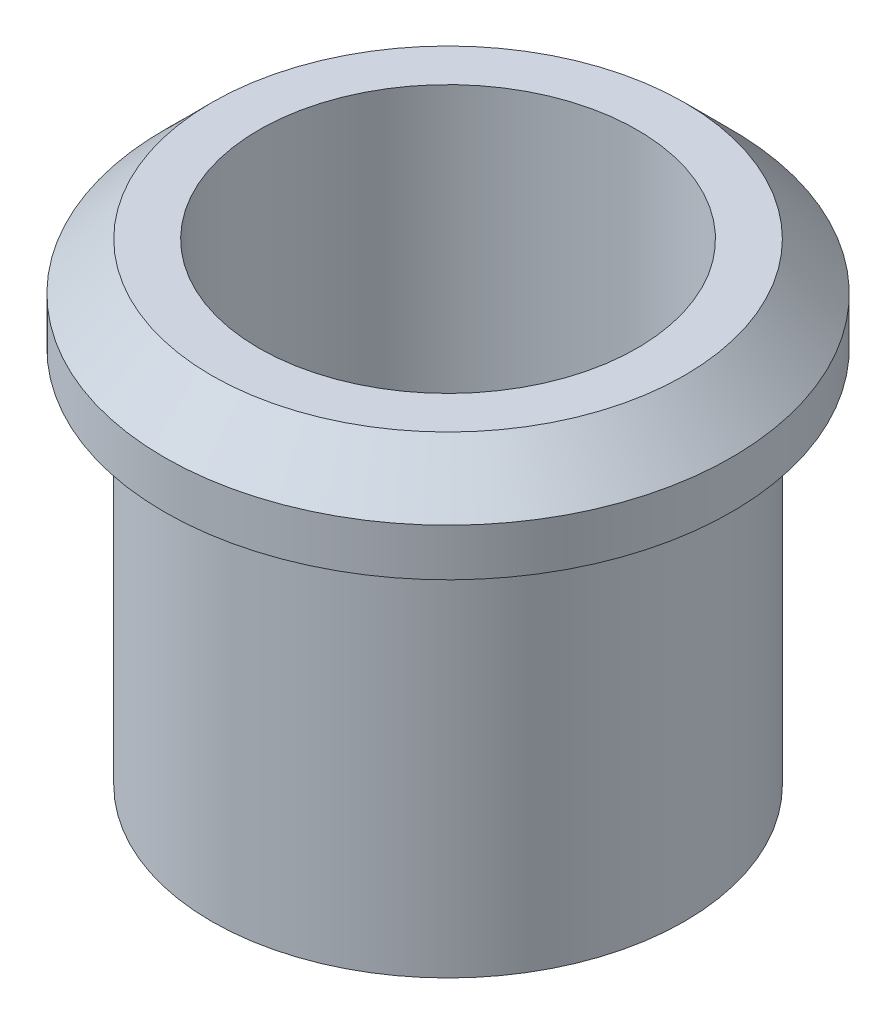
ISO-10303-21;
HEADER;
FILE_DESCRIPTION(('STEP AP214'),'2;1');
FILE_NAME('part.step','',(''),(''),'','','');
FILE_SCHEMA(('AUTOMOTIVE_DESIGN { 1 0 10303 214 1 1 1 1 }'));
ENDSEC;
DATA;
#1=APPLICATION_CONTEXT('core data for automotive mechanical design processes');
#2=APPLICATION_PROTOCOL_DEFINITION('international standard','automotive_design',2000,#1);
#3=PRODUCT_CONTEXT('',#1,'mechanical');
#4=PRODUCT('Part','Part','',(#3));
#5=PRODUCT_RELATED_PRODUCT_CATEGORY('part','',(#4));
#6=PRODUCT_DEFINITION_FORMATION('','',#4);
#7=PRODUCT_DEFINITION_CONTEXT('part definition',#1,'design');
#8=PRODUCT_DEFINITION('design','',#6,#7);
#9=PRODUCT_DEFINITION_SHAPE('','',#8);
#10=(LENGTH_UNIT() NAMED_UNIT(*) SI_UNIT(.MILLI.,.METRE.));
#11=(NAMED_UNIT(*) PLANE_ANGLE_UNIT() SI_UNIT($,.RADIAN.));
#12=(NAMED_UNIT(*) SI_UNIT($,.STERADIAN.) SOLID_ANGLE_UNIT());
#13=UNCERTAINTY_MEASURE_WITH_UNIT(LENGTH_MEASURE(1.E-05),#10,'distance_accuracy_value','');
#14=(GEOMETRIC_REPRESENTATION_CONTEXT(3) GLOBAL_UNCERTAINTY_ASSIGNED_CONTEXT((#13)) GLOBAL_UNIT_ASSIGNED_CONTEXT((#10,
#11,#12)) REPRESENTATION_CONTEXT('',''));
#15=CARTESIAN_POINT('',(0.,0.,0.));
#16=DIRECTION('',(0.,0.,1.));
#17=DIRECTION('',(1.,0.,0.));
#18=AXIS2_PLACEMENT_3D('',#15,#16,#17);
#19=CARTESIAN_POINT('',(0.,0.,0.));
#20=DIRECTION('',(0.,1.,0.));
#21=DIRECTION('',(0.,0.,1.));
#22=AXIS2_PLACEMENT_3D('',#19,#20,#21);
#23=PLANE('',#22);
#24=CARTESIAN_POINT('',(0.,0.,0.));
#25=DIRECTION('',(0.,1.,0.));
#26=DIRECTION('',(0.,0.,1.));
#27=AXIS2_PLACEMENT_3D('',#24,#25,#26);
#28=CIRCLE('',#27,2.5);
#29=CARTESIAN_POINT('',(0.,0.,2.5));
#30=VERTEX_POINT('',#29);
#31=EDGE_CURVE('E48',#30,#30,#28,.T.);
#32=ORIENTED_EDGE('',*,*,#31,.F.);
#33=EDGE_LOOP('',(#32));
#34=FACE_BOUND('',#33,.T.);
#35=CARTESIAN_POINT('',(0.,0.,0.));
#36=DIRECTION('',(0.,1.,0.));
#37=DIRECTION('',(0.,0.,1.));
#38=AXIS2_PLACEMENT_3D('',#35,#36,#37);
#39=CIRCLE('',#38,2.);
#40=CARTESIAN_POINT('',(0.,0.,2.));
#41=VERTEX_POINT('',#40);
#42=EDGE_CURVE('E52',#41,#41,#39,.T.);
#43=ORIENTED_EDGE('',*,*,#42,.T.);
#44=EDGE_LOOP('',(#43));
#45=FACE_BOUND('',#44,.T.);
#46=ADVANCED_FACE('F32',(#34,#45),#23,.F.);
#47=CARTESIAN_POINT('',(0.,4.,0.));
#48=DIRECTION('',(0.,-1.,0.));
#49=DIRECTION('',(0.,0.,-1.));
#50=AXIS2_PLACEMENT_3D('',#47,#48,#49);
#51=CYLINDRICAL_SURFACE('',#50,2.5);
#52=CARTESIAN_POINT('',(0.,4.,0.));
#53=DIRECTION('',(0.,1.,0.));
#54=DIRECTION('',(0.,0.,1.));
#55=AXIS2_PLACEMENT_3D('',#52,#53,#54);
#56=CIRCLE('',#55,2.5);
#57=CARTESIAN_POINT('',(0.,4.,2.5));
#58=VERTEX_POINT('',#57);
#59=EDGE_CURVE('E44',#58,#58,#56,.T.);
#60=ORIENTED_EDGE('',*,*,#59,.F.);
#61=EDGE_LOOP('',(#60));
#62=FACE_BOUND('',#61,.T.);
#63=ORIENTED_EDGE('',*,*,#31,.T.);
#64=EDGE_LOOP('',(#63));
#65=FACE_BOUND('',#64,.T.);
#66=ADVANCED_FACE('F76',(#62,#65),#51,.T.);
#67=CARTESIAN_POINT('',(0.,4.,0.));
#68=DIRECTION('',(0.,-1.,0.));
#69=DIRECTION('',(0.,0.,-1.));
#70=AXIS2_PLACEMENT_3D('',#67,#68,#69);
#71=CYLINDRICAL_SURFACE('',#70,2.);
#72=ORIENTED_EDGE('',*,*,#42,.F.);
#73=EDGE_LOOP('',(#72));
#74=FACE_BOUND('',#73,.T.);
#75=CARTESIAN_POINT('',(0.,5.,0.));
#76=DIRECTION('',(0.,1.,0.));
#77=DIRECTION('',(0.,0.,1.));
#78=AXIS2_PLACEMENT_3D('',#75,#76,#77);
#79=CIRCLE('',#78,2.);
#80=CARTESIAN_POINT('',(0.,5.,2.));
#81=VERTEX_POINT('',#80);
#82=EDGE_CURVE('E59',#81,#81,#79,.T.);
#83=ORIENTED_EDGE('',*,*,#82,.T.);
#84=EDGE_LOOP('',(#83));
#85=FACE_BOUND('',#84,.T.);
#86=ADVANCED_FACE('F63',(#74,#85),#71,.F.);
#87=CARTESIAN_POINT('',(0.,5.,0.));
#88=DIRECTION('',(0.,1.,0.));
#89=DIRECTION('',(0.,0.,1.));
#90=AXIS2_PLACEMENT_3D('',#87,#88,#89);
#91=PLANE('',#90);
#92=CARTESIAN_POINT('',(0.,5.,0.));
#93=DIRECTION('',(0.,1.,0.));
#94=DIRECTION('',(0.,0.,1.));
#95=AXIS2_PLACEMENT_3D('',#92,#93,#94);
#96=CIRCLE('',#95,2.5);
#97=CARTESIAN_POINT('',(0.,5.,2.5));
#98=VERTEX_POINT('',#97);
#99=EDGE_CURVE('E40',#98,#98,#96,.T.);
#100=ORIENTED_EDGE('',*,*,#99,.T.);
#101=EDGE_LOOP('',(#100));
#102=FACE_BOUND('',#101,.T.);
#103=ORIENTED_EDGE('',*,*,#82,.F.);
#104=EDGE_LOOP('',(#103));
#105=FACE_BOUND('',#104,.T.);
#106=ADVANCED_FACE('F65',(#102,#105),#91,.T.);
#107=CARTESIAN_POINT('',(0.,4.,0.));
#108=DIRECTION('',(0.,1.,0.));
#109=DIRECTION('',(0.,0.,1.));
#110=AXIS2_PLACEMENT_3D('',#107,#108,#109);
#111=PLANE('',#110);
#112=ORIENTED_EDGE('',*,*,#59,.T.);
#113=EDGE_LOOP('',(#112));
#114=FACE_BOUND('',#113,.T.);
#115=CARTESIAN_POINT('',(0.,4.,0.));
#116=DIRECTION('',(0.,1.,0.));
#117=DIRECTION('',(0.,0.,1.));
#118=AXIS2_PLACEMENT_3D('',#115,#116,#117);
#119=CIRCLE('',#118,3.);
#120=CARTESIAN_POINT('',(0.,4.,3.));
#121=VERTEX_POINT('',#120);
#122=EDGE_CURVE('E56',#121,#121,#119,.T.);
#123=ORIENTED_EDGE('',*,*,#122,.F.);
#124=EDGE_LOOP('',(#123));
#125=FACE_BOUND('',#124,.T.);
#126=ADVANCED_FACE('F67',(#114,#125),#111,.F.);
#127=CARTESIAN_POINT('',(0.,5.,0.));
#128=DIRECTION('',(0.,-1.,0.));
#129=DIRECTION('',(0.,0.,-1.));
#130=AXIS2_PLACEMENT_3D('',#127,#128,#129);
#131=CYLINDRICAL_SURFACE('',#130,3.);
#132=CARTESIAN_POINT('',(0.,4.5,0.));
#133=DIRECTION('',(0.,1.,0.));
#134=DIRECTION('',(0.,0.,1.));
#135=AXIS2_PLACEMENT_3D('',#132,#133,#134);
#136=CIRCLE('',#135,3.);
#137=CARTESIAN_POINT('',(0.,4.5,3.));
#138=VERTEX_POINT('',#137);
#139=EDGE_CURVE('E10',#138,#138,#136,.F.);
#140=ORIENTED_EDGE('',*,*,#139,.T.);
#141=EDGE_LOOP('',(#140));
#142=FACE_BOUND('',#141,.T.);
#143=ORIENTED_EDGE('',*,*,#122,.T.);
#144=EDGE_LOOP('',(#143));
#145=FACE_BOUND('',#144,.T.);
#146=ADVANCED_FACE('F73',(#142,#145),#131,.T.);
#147=CARTESIAN_POINT('',(0.,5.,0.));
#148=DIRECTION('',(0.,-1.,0.));
#149=DIRECTION('',(0.,0.,-1.));
#150=AXIS2_PLACEMENT_3D('',#147,#148,#149);
#151=CONICAL_SURFACE('',#150,2.5,0.785398163397447);
#152=ORIENTED_EDGE('',*,*,#139,.F.);
#153=EDGE_LOOP('',(#152));
#154=FACE_BOUND('',#153,.T.);
#155=ORIENTED_EDGE('',*,*,#99,.F.);
#156=EDGE_LOOP('',(#155));
#157=FACE_BOUND('',#156,.T.);
#158=ADVANCED_FACE('F35',(#154,#157),#151,.T.);
#159=CLOSED_SHELL('',(#46,#66,#86,#106,#126,#146,#158));
#160=MANIFOLD_SOLID_BREP('B2',#159);
#161=ADVANCED_BREP_SHAPE_REPRESENTATION('',(#18,#160),#14);
#162=SHAPE_DEFINITION_REPRESENTATION(#9,#161);
ENDSEC;
END-ISO-10303-21;
